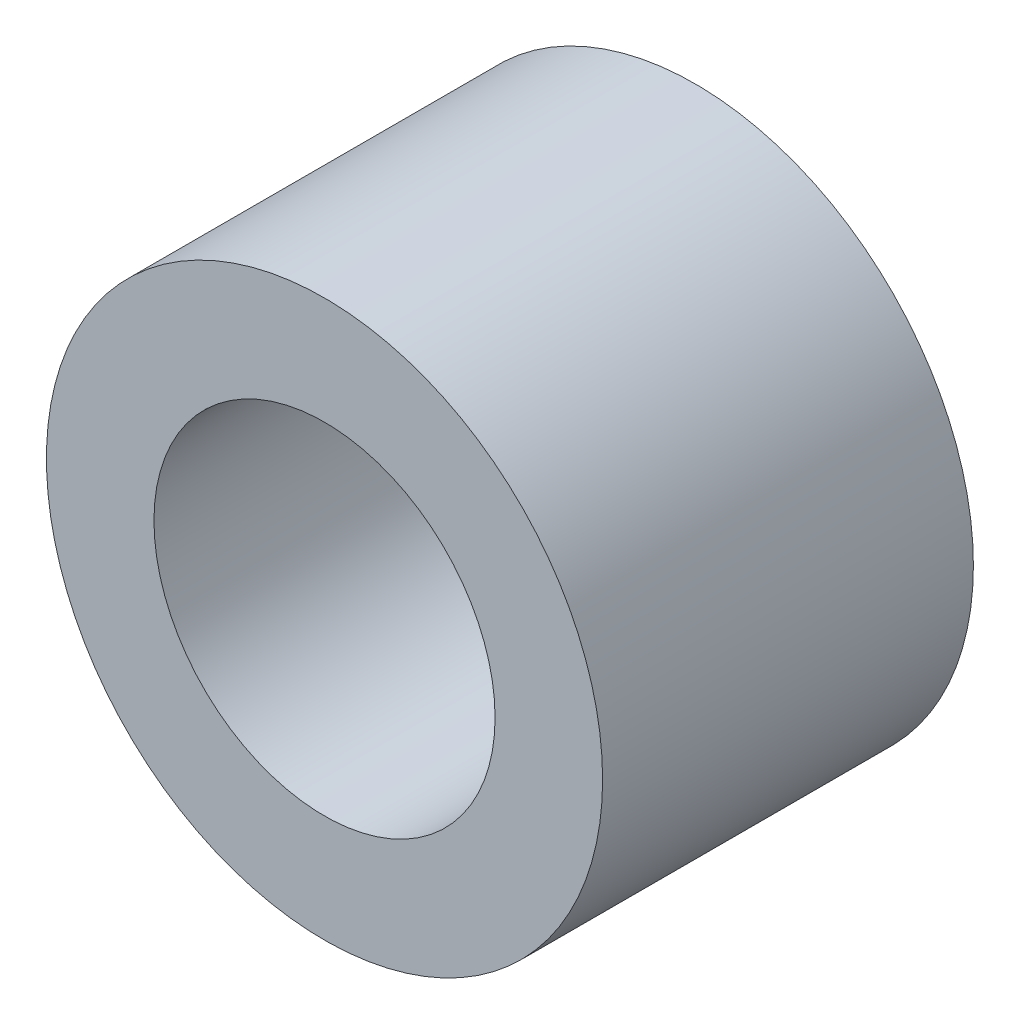
ISO-10303-21;
HEADER;
FILE_DESCRIPTION(('STEP AP214'),'2;1');
FILE_NAME('part.step','',(''),(''),'','','');
FILE_SCHEMA(('AUTOMOTIVE_DESIGN { 1 0 10303 214 1 1 1 1 }'));
ENDSEC;
DATA;
#1=APPLICATION_CONTEXT('core data for automotive mechanical design processes');
#2=APPLICATION_PROTOCOL_DEFINITION('international standard','automotive_design',2000,#1);
#3=PRODUCT_CONTEXT('',#1,'mechanical');
#4=PRODUCT('Part','Part','',(#3));
#5=PRODUCT_RELATED_PRODUCT_CATEGORY('part','',(#4));
#6=PRODUCT_DEFINITION_FORMATION('','',#4);
#7=PRODUCT_DEFINITION_CONTEXT('part definition',#1,'design');
#8=PRODUCT_DEFINITION('design','',#6,#7);
#9=PRODUCT_DEFINITION_SHAPE('','',#8);
#10=(LENGTH_UNIT() NAMED_UNIT(*) SI_UNIT(.MILLI.,.METRE.));
#11=(NAMED_UNIT(*) PLANE_ANGLE_UNIT() SI_UNIT($,.RADIAN.));
#12=(NAMED_UNIT(*) SI_UNIT($,.STERADIAN.) SOLID_ANGLE_UNIT());
#13=UNCERTAINTY_MEASURE_WITH_UNIT(LENGTH_MEASURE(1.E-05),#10,'distance_accuracy_value','');
#14=(GEOMETRIC_REPRESENTATION_CONTEXT(3) GLOBAL_UNCERTAINTY_ASSIGNED_CONTEXT((#13)) GLOBAL_UNIT_ASSIGNED_CONTEXT((#10,
#11,#12)) REPRESENTATION_CONTEXT('',''));
#15=CARTESIAN_POINT('',(0.,0.,0.));
#16=DIRECTION('',(0.,0.,1.));
#17=DIRECTION('',(1.,0.,0.));
#18=AXIS2_PLACEMENT_3D('',#15,#16,#17);
#19=CARTESIAN_POINT('',(0.,0.,1.5875));
#20=DIRECTION('',(0.,0.,1.));
#21=DIRECTION('',(1.,0.,0.));
#22=AXIS2_PLACEMENT_3D('',#19,#20,#21);
#23=PLANE('',#22);
#24=CARTESIAN_POINT('',(0.,0.,1.5875));
#25=DIRECTION('',(0.,0.,1.));
#26=DIRECTION('',(1.,0.,0.));
#27=AXIS2_PLACEMENT_3D('',#24,#25,#26);
#28=CIRCLE('',#27,2.38125);
#29=CARTESIAN_POINT('',(2.38125,0.,1.5875));
#30=VERTEX_POINT('',#29);
#31=EDGE_CURVE('E10',#30,#30,#28,.T.);
#32=ORIENTED_EDGE('',*,*,#31,.T.);
#33=EDGE_LOOP('',(#32));
#34=FACE_BOUND('',#33,.T.);
#35=CARTESIAN_POINT('',(0.,0.,1.5875));
#36=DIRECTION('',(0.,0.,1.));
#37=DIRECTION('',(1.,0.,0.));
#38=AXIS2_PLACEMENT_3D('',#35,#36,#37);
#39=CIRCLE('',#38,1.4605);
#40=CARTESIAN_POINT('',(1.4605,0.,1.5875));
#41=VERTEX_POINT('',#40);
#42=EDGE_CURVE('E42',#41,#41,#39,.T.);
#43=ORIENTED_EDGE('',*,*,#42,.F.);
#44=EDGE_LOOP('',(#43));
#45=FACE_BOUND('',#44,.T.);
#46=ADVANCED_FACE('F31',(#34,#45),#23,.T.);
#47=CARTESIAN_POINT('',(0.,0.,-1.5875));
#48=DIRECTION('',(0.,0.,1.));
#49=DIRECTION('',(1.,0.,0.));
#50=AXIS2_PLACEMENT_3D('',#47,#48,#49);
#51=PLANE('',#50);
#52=CARTESIAN_POINT('',(0.,0.,-1.5875));
#53=DIRECTION('',(0.,0.,1.));
#54=DIRECTION('',(1.,0.,0.));
#55=AXIS2_PLACEMENT_3D('',#52,#53,#54);
#56=CIRCLE('',#55,2.38125);
#57=CARTESIAN_POINT('',(2.38125,0.,-1.5875));
#58=VERTEX_POINT('',#57);
#59=EDGE_CURVE('E35',#58,#58,#56,.T.);
#60=ORIENTED_EDGE('',*,*,#59,.F.);
#61=EDGE_LOOP('',(#60));
#62=FACE_BOUND('',#61,.T.);
#63=CARTESIAN_POINT('',(0.,0.,-1.5875));
#64=DIRECTION('',(0.,0.,1.));
#65=DIRECTION('',(1.,0.,0.));
#66=AXIS2_PLACEMENT_3D('',#63,#64,#65);
#67=CIRCLE('',#66,1.4605);
#68=CARTESIAN_POINT('',(1.4605,0.,-1.5875));
#69=VERTEX_POINT('',#68);
#70=EDGE_CURVE('E44',#69,#69,#67,.T.);
#71=ORIENTED_EDGE('',*,*,#70,.T.);
#72=EDGE_LOOP('',(#71));
#73=FACE_BOUND('',#72,.T.);
#74=ADVANCED_FACE('F54',(#62,#73),#51,.F.);
#75=CARTESIAN_POINT('',(0.,0.,1.5875));
#76=DIRECTION('',(0.,0.,-1.));
#77=DIRECTION('',(-1.,0.,0.));
#78=AXIS2_PLACEMENT_3D('',#75,#76,#77);
#79=CYLINDRICAL_SURFACE('',#78,2.38125);
#80=ORIENTED_EDGE('',*,*,#31,.F.);
#81=EDGE_LOOP('',(#80));
#82=FACE_BOUND('',#81,.T.);
#83=ORIENTED_EDGE('',*,*,#59,.T.);
#84=EDGE_LOOP('',(#83));
#85=FACE_BOUND('',#84,.T.);
#86=ADVANCED_FACE('F33',(#82,#85),#79,.T.);
#87=CARTESIAN_POINT('',(0.,0.,1.5875));
#88=DIRECTION('',(0.,0.,-1.));
#89=DIRECTION('',(-1.,0.,0.));
#90=AXIS2_PLACEMENT_3D('',#87,#88,#89);
#91=CYLINDRICAL_SURFACE('',#90,1.4605);
#92=ORIENTED_EDGE('',*,*,#42,.T.);
#93=EDGE_LOOP('',(#92));
#94=FACE_BOUND('',#93,.T.);
#95=ORIENTED_EDGE('',*,*,#70,.F.);
#96=EDGE_LOOP('',(#95));
#97=FACE_BOUND('',#96,.T.);
#98=ADVANCED_FACE('F50',(#94,#97),#91,.F.);
#99=CLOSED_SHELL('',(#46,#74,#86,#98));
#100=MANIFOLD_SOLID_BREP('B2',#99);
#101=ADVANCED_BREP_SHAPE_REPRESENTATION('',(#18,#100),#14);
#102=SHAPE_DEFINITION_REPRESENTATION(#9,#101);
ENDSEC;
END-ISO-10303-21;
